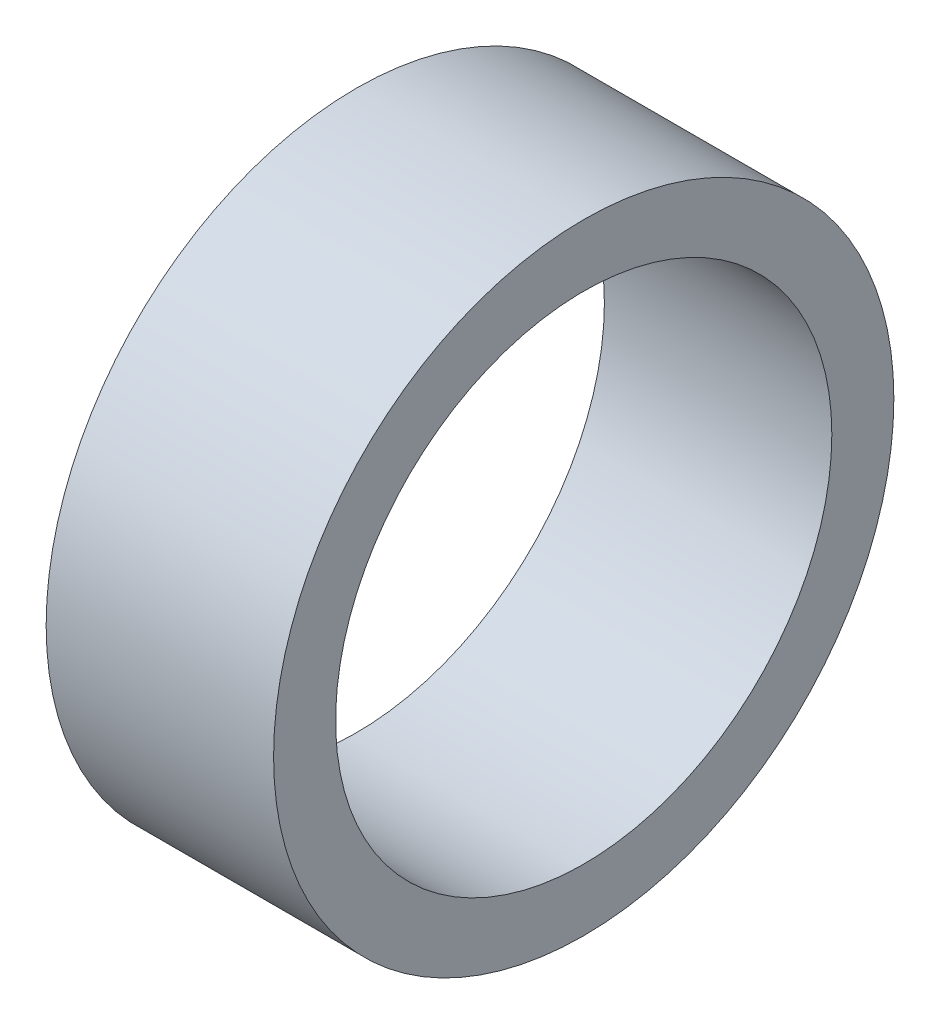
ISO-10303-21;
HEADER;
FILE_DESCRIPTION(('STEP AP214'),'2;1');
FILE_NAME('part.step','',(''),(''),'','','');
FILE_SCHEMA(('AUTOMOTIVE_DESIGN { 1 0 10303 214 1 1 1 1 }'));
ENDSEC;
DATA;
#1=APPLICATION_CONTEXT('core data for automotive mechanical design processes');
#2=APPLICATION_PROTOCOL_DEFINITION('international standard','automotive_design',2000,#1);
#3=PRODUCT_CONTEXT('',#1,'mechanical');
#4=PRODUCT('Part','Part','',(#3));
#5=PRODUCT_RELATED_PRODUCT_CATEGORY('part','',(#4));
#6=PRODUCT_DEFINITION_FORMATION('','',#4);
#7=PRODUCT_DEFINITION_CONTEXT('part definition',#1,'design');
#8=PRODUCT_DEFINITION('design','',#6,#7);
#9=PRODUCT_DEFINITION_SHAPE('','',#8);
#10=(LENGTH_UNIT() NAMED_UNIT(*) SI_UNIT(.MILLI.,.METRE.));
#11=(NAMED_UNIT(*) PLANE_ANGLE_UNIT() SI_UNIT($,.RADIAN.));
#12=(NAMED_UNIT(*) SI_UNIT($,.STERADIAN.) SOLID_ANGLE_UNIT());
#13=UNCERTAINTY_MEASURE_WITH_UNIT(LENGTH_MEASURE(1.E-05),#10,'distance_accuracy_value','');
#14=(GEOMETRIC_REPRESENTATION_CONTEXT(3) GLOBAL_UNCERTAINTY_ASSIGNED_CONTEXT((#13)) GLOBAL_UNIT_ASSIGNED_CONTEXT((#10,
#11,#12)) REPRESENTATION_CONTEXT('',''));
#15=CARTESIAN_POINT('',(0.,0.,0.));
#16=DIRECTION('',(0.,0.,1.));
#17=DIRECTION('',(1.,0.,0.));
#18=AXIS2_PLACEMENT_3D('',#15,#16,#17);
#19=CARTESIAN_POINT('',(24.75,0.,0.));
#20=DIRECTION('',(1.,0.,0.));
#21=DIRECTION('',(0.,0.,-1.));
#22=AXIS2_PLACEMENT_3D('',#19,#20,#21);
#23=CYLINDRICAL_SURFACE('',#22,6.);
#24=CARTESIAN_POINT('',(27.5,0.,0.));
#25=DIRECTION('',(1.,0.,0.));
#26=DIRECTION('',(0.,0.,-1.));
#27=AXIS2_PLACEMENT_3D('',#24,#25,#26);
#28=CIRCLE('',#27,6.);
#29=CARTESIAN_POINT('',(27.5,0.,-6.));
#30=VERTEX_POINT('',#29);
#31=EDGE_CURVE('E18',#30,#30,#28,.F.);
#32=ORIENTED_EDGE('',*,*,#31,.F.);
#33=EDGE_LOOP('',(#32));
#34=FACE_BOUND('',#33,.T.);
#35=CARTESIAN_POINT('',(22.,0.,0.));
#36=DIRECTION('',(1.,0.,0.));
#37=DIRECTION('',(0.,0.,-1.));
#38=AXIS2_PLACEMENT_3D('',#35,#36,#37);
#39=CIRCLE('',#38,6.);
#40=CARTESIAN_POINT('',(22.,0.,-6.));
#41=VERTEX_POINT('',#40);
#42=EDGE_CURVE('E27',#41,#41,#39,.T.);
#43=ORIENTED_EDGE('',*,*,#42,.F.);
#44=EDGE_LOOP('',(#43));
#45=FACE_BOUND('',#44,.T.);
#46=ADVANCED_FACE('F15',(#34,#45),#23,.F.);
#47=CARTESIAN_POINT('',(27.5,6.75,0.));
#48=DIRECTION('',(1.,0.,0.));
#49=DIRECTION('',(0.,0.,-1.));
#50=AXIS2_PLACEMENT_3D('',#47,#48,#49);
#51=PLANE('',#50);
#52=ORIENTED_EDGE('',*,*,#31,.T.);
#53=EDGE_LOOP('',(#52));
#54=FACE_BOUND('',#53,.T.);
#55=CARTESIAN_POINT('',(27.5,0.,0.));
#56=DIRECTION('',(1.,0.,0.));
#57=DIRECTION('',(0.,0.,-1.));
#58=AXIS2_PLACEMENT_3D('',#55,#56,#57);
#59=CIRCLE('',#58,7.5);
#60=CARTESIAN_POINT('',(27.5,0.,-7.5));
#61=VERTEX_POINT('',#60);
#62=EDGE_CURVE('E22',#61,#61,#59,.F.);
#63=ORIENTED_EDGE('',*,*,#62,.F.);
#64=EDGE_LOOP('',(#63));
#65=FACE_BOUND('',#64,.T.);
#66=ADVANCED_FACE('F35',(#54,#65),#51,.T.);
#67=CARTESIAN_POINT('',(22.,6.75,0.));
#68=DIRECTION('',(-1.,0.,0.));
#69=DIRECTION('',(0.,0.,1.));
#70=AXIS2_PLACEMENT_3D('',#67,#68,#69);
#71=PLANE('',#70);
#72=CARTESIAN_POINT('',(22.,0.,0.));
#73=DIRECTION('',(1.,0.,0.));
#74=DIRECTION('',(0.,0.,-1.));
#75=AXIS2_PLACEMENT_3D('',#72,#73,#74);
#76=CIRCLE('',#75,7.5);
#77=CARTESIAN_POINT('',(22.,0.,-7.5));
#78=VERTEX_POINT('',#77);
#79=EDGE_CURVE('E10',#78,#78,#76,.T.);
#80=ORIENTED_EDGE('',*,*,#79,.F.);
#81=EDGE_LOOP('',(#80));
#82=FACE_BOUND('',#81,.T.);
#83=ORIENTED_EDGE('',*,*,#42,.T.);
#84=EDGE_LOOP('',(#83));
#85=FACE_BOUND('',#84,.T.);
#86=ADVANCED_FACE('F44',(#82,#85),#71,.T.);
#87=CARTESIAN_POINT('',(24.75,0.,0.));
#88=DIRECTION('',(1.,0.,0.));
#89=DIRECTION('',(0.,0.,-1.));
#90=AXIS2_PLACEMENT_3D('',#87,#88,#89);
#91=CYLINDRICAL_SURFACE('',#90,7.5);
#92=ORIENTED_EDGE('',*,*,#62,.T.);
#93=EDGE_LOOP('',(#92));
#94=FACE_BOUND('',#93,.T.);
#95=ORIENTED_EDGE('',*,*,#79,.T.);
#96=EDGE_LOOP('',(#95));
#97=FACE_BOUND('',#96,.T.);
#98=ADVANCED_FACE('F45',(#94,#97),#91,.T.);
#99=CLOSED_SHELL('',(#46,#66,#86,#98));
#100=MANIFOLD_SOLID_BREP('B1',#99);
#101=ADVANCED_BREP_SHAPE_REPRESENTATION('',(#18,#100),#14);
#102=SHAPE_DEFINITION_REPRESENTATION(#9,#101);
ENDSEC;
END-ISO-10303-21;
